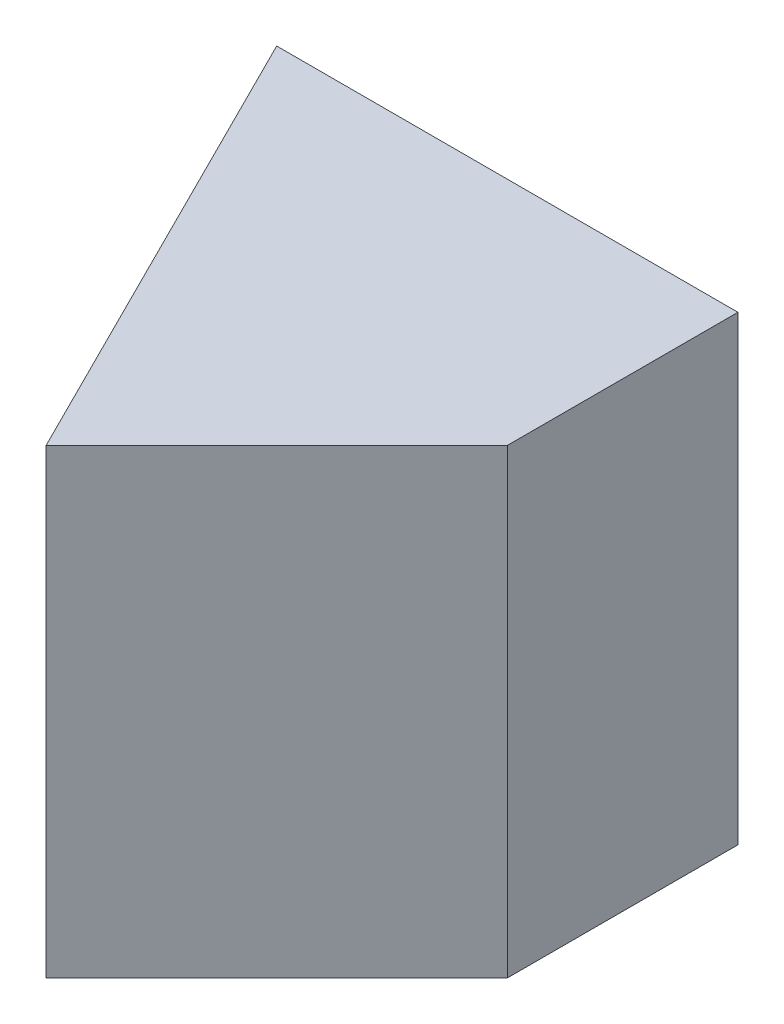
ISO-10303-21;
HEADER;
FILE_DESCRIPTION(('STEP AP214'),'2;1');
FILE_NAME('part.step','',(''),(''),'','','');
FILE_SCHEMA(('AUTOMOTIVE_DESIGN { 1 0 10303 214 1 1 1 1 }'));
ENDSEC;
DATA;
#1=APPLICATION_CONTEXT('core data for automotive mechanical design processes');
#2=APPLICATION_PROTOCOL_DEFINITION('international standard','automotive_design',2000,#1);
#3=PRODUCT_CONTEXT('',#1,'mechanical');
#4=PRODUCT('Part','Part','',(#3));
#5=PRODUCT_RELATED_PRODUCT_CATEGORY('part','',(#4));
#6=PRODUCT_DEFINITION_FORMATION('','',#4);
#7=PRODUCT_DEFINITION_CONTEXT('part definition',#1,'design');
#8=PRODUCT_DEFINITION('design','',#6,#7);
#9=PRODUCT_DEFINITION_SHAPE('','',#8);
#10=(LENGTH_UNIT() NAMED_UNIT(*) SI_UNIT(.MILLI.,.METRE.));
#11=(NAMED_UNIT(*) PLANE_ANGLE_UNIT() SI_UNIT($,.RADIAN.));
#12=(NAMED_UNIT(*) SI_UNIT($,.STERADIAN.) SOLID_ANGLE_UNIT());
#13=UNCERTAINTY_MEASURE_WITH_UNIT(LENGTH_MEASURE(1.E-05),#10,'distance_accuracy_value','');
#14=(GEOMETRIC_REPRESENTATION_CONTEXT(3) GLOBAL_UNCERTAINTY_ASSIGNED_CONTEXT((#13)) GLOBAL_UNIT_ASSIGNED_CONTEXT((#10,
#11,#12)) REPRESENTATION_CONTEXT('',''));
#15=CARTESIAN_POINT('',(0.,0.,0.));
#16=DIRECTION('',(0.,0.,1.));
#17=DIRECTION('',(1.,0.,0.));
#18=AXIS2_PLACEMENT_3D('',#15,#16,#17);
#19=CARTESIAN_POINT('',(0.,0.,20.));
#20=DIRECTION('',(0.,1.,0.));
#21=DIRECTION('',(0.,0.,1.));
#22=AXIS2_PLACEMENT_3D('',#19,#20,#21);
#23=PLANE('',#22);
#24=DIRECTION('',(0.,0.,-1.));
#25=VECTOR('',#24,1.);
#26=CARTESIAN_POINT('',(20.,0.,20.));
#27=LINE('',#26,#25);
#28=CARTESIAN_POINT('',(20.,0.,10.));
#29=VERTEX_POINT('',#28);
#30=CARTESIAN_POINT('',(20.,0.,0.));
#31=VERTEX_POINT('',#30);
#32=EDGE_CURVE('E11',#29,#31,#27,.T.);
#33=ORIENTED_EDGE('',*,*,#32,.F.);
#34=DIRECTION('',(-0.707106781186548,0.,0.707106781186548));
#35=VECTOR('',#34,1.);
#36=CARTESIAN_POINT('',(20.,0.,10.));
#37=LINE('',#36,#35);
#38=CARTESIAN_POINT('',(10.,0.,20.));
#39=VERTEX_POINT('',#38);
#40=EDGE_CURVE('E72',#29,#39,#37,.T.);
#41=ORIENTED_EDGE('',*,*,#40,.T.);
#42=DIRECTION('',(-0.447213595499958,0.,-0.894427190999916));
#43=VECTOR('',#42,1.);
#44=CARTESIAN_POINT('',(0.,0.,0.));
#45=LINE('',#44,#43);
#46=CARTESIAN_POINT('',(0.,0.,0.));
#47=VERTEX_POINT('',#46);
#48=EDGE_CURVE('E90',#39,#47,#45,.T.);
#49=ORIENTED_EDGE('',*,*,#48,.T.);
#50=DIRECTION('',(1.,0.,0.));
#51=VECTOR('',#50,1.);
#52=CARTESIAN_POINT('',(0.,0.,0.));
#53=LINE('',#52,#51);
#54=EDGE_CURVE('E88',#47,#31,#53,.T.);
#55=ORIENTED_EDGE('',*,*,#54,.T.);
#56=EDGE_LOOP('',(#33,#41,#49,#55));
#57=FACE_BOUND('',#56,.T.);
#58=ADVANCED_FACE('F33',(#57),#23,.F.);
#59=CARTESIAN_POINT('',(20.,0.,20.));
#60=DIRECTION('',(-1.,0.,0.));
#61=DIRECTION('',(0.,0.,1.));
#62=AXIS2_PLACEMENT_3D('',#59,#60,#61);
#63=PLANE('',#62);
#64=DIRECTION('',(0.,0.,-1.));
#65=VECTOR('',#64,1.);
#66=CARTESIAN_POINT('',(20.,20.,20.));
#67=LINE('',#66,#65);
#68=CARTESIAN_POINT('',(20.,20.,10.));
#69=VERTEX_POINT('',#68);
#70=CARTESIAN_POINT('',(20.,20.,0.));
#71=VERTEX_POINT('',#70);
#72=EDGE_CURVE('E40',#69,#71,#67,.T.);
#73=ORIENTED_EDGE('',*,*,#72,.F.);
#74=DIRECTION('',(0.,1.,0.));
#75=VECTOR('',#74,1.);
#76=CARTESIAN_POINT('',(20.,0.,10.));
#77=LINE('',#76,#75);
#78=EDGE_CURVE('E75',#29,#69,#77,.T.);
#79=ORIENTED_EDGE('',*,*,#78,.F.);
#80=ORIENTED_EDGE('',*,*,#32,.T.);
#81=DIRECTION('',(0.,1.,0.));
#82=VECTOR('',#81,1.);
#83=CARTESIAN_POINT('',(20.,0.,0.));
#84=LINE('',#83,#82);
#85=EDGE_CURVE('E93',#31,#71,#84,.T.);
#86=ORIENTED_EDGE('',*,*,#85,.T.);
#87=EDGE_LOOP('',(#73,#79,#80,#86));
#88=FACE_BOUND('',#87,.T.);
#89=ADVANCED_FACE('F84',(#88),#63,.F.);
#90=CARTESIAN_POINT('',(0.,20.,20.));
#91=DIRECTION('',(0.,-1.,0.));
#92=DIRECTION('',(0.,0.,-1.));
#93=AXIS2_PLACEMENT_3D('',#90,#91,#92);
#94=PLANE('',#93);
#95=DIRECTION('',(-0.447213595499958,0.,-0.894427190999916));
#96=VECTOR('',#95,1.);
#97=CARTESIAN_POINT('',(0.,20.,0.));
#98=LINE('',#97,#96);
#99=CARTESIAN_POINT('',(10.,20.,20.));
#100=VERTEX_POINT('',#99);
#101=CARTESIAN_POINT('',(0.,20.,0.));
#102=VERTEX_POINT('',#101);
#103=EDGE_CURVE('E47',#100,#102,#98,.T.);
#104=ORIENTED_EDGE('',*,*,#103,.F.);
#105=DIRECTION('',(-0.707106781186548,0.,0.707106781186548));
#106=VECTOR('',#105,1.);
#107=CARTESIAN_POINT('',(20.,20.,10.));
#108=LINE('',#107,#106);
#109=EDGE_CURVE('E81',#69,#100,#108,.T.);
#110=ORIENTED_EDGE('',*,*,#109,.F.);
#111=ORIENTED_EDGE('',*,*,#72,.T.);
#112=DIRECTION('',(-1.,0.,0.));
#113=VECTOR('',#112,1.);
#114=CARTESIAN_POINT('',(0.,20.,0.));
#115=LINE('',#114,#113);
#116=EDGE_CURVE('E98',#71,#102,#115,.T.);
#117=ORIENTED_EDGE('',*,*,#116,.T.);
#118=EDGE_LOOP('',(#104,#110,#111,#117));
#119=FACE_BOUND('',#118,.T.);
#120=ADVANCED_FACE('F107',(#119),#94,.F.);
#121=CARTESIAN_POINT('',(0.,0.,0.));
#122=DIRECTION('',(0.,0.,-1.));
#123=DIRECTION('',(-1.,0.,0.));
#124=AXIS2_PLACEMENT_3D('',#121,#122,#123);
#125=PLANE('',#124);
#126=DIRECTION('',(0.,-1.,0.));
#127=VECTOR('',#126,1.);
#128=CARTESIAN_POINT('',(0.,0.,0.));
#129=LINE('',#128,#127);
#130=EDGE_CURVE('E94',#102,#47,#129,.T.);
#131=ORIENTED_EDGE('',*,*,#130,.F.);
#132=ORIENTED_EDGE('',*,*,#116,.F.);
#133=ORIENTED_EDGE('',*,*,#85,.F.);
#134=ORIENTED_EDGE('',*,*,#54,.F.);
#135=EDGE_LOOP('',(#131,#132,#133,#134));
#136=FACE_BOUND('',#135,.T.);
#137=ADVANCED_FACE('F97',(#136),#125,.T.);
#138=CARTESIAN_POINT('',(0.,0.,0.));
#139=DIRECTION('',(0.894427190999916,0.,-0.447213595499958));
#140=DIRECTION('',(-0.447213595499958,0.,-0.894427190999916));
#141=AXIS2_PLACEMENT_3D('',#138,#139,#140);
#142=PLANE('',#141);
#143=ORIENTED_EDGE('',*,*,#103,.T.);
#144=ORIENTED_EDGE('',*,*,#130,.T.);
#145=ORIENTED_EDGE('',*,*,#48,.F.);
#146=DIRECTION('',(0.,1.,0.));
#147=VECTOR('',#146,1.);
#148=CARTESIAN_POINT('',(10.,0.,20.));
#149=LINE('',#148,#147);
#150=EDGE_CURVE('E76',#39,#100,#149,.T.);
#151=ORIENTED_EDGE('',*,*,#150,.T.);
#152=EDGE_LOOP('',(#143,#144,#145,#151));
#153=FACE_BOUND('',#152,.T.);
#154=ADVANCED_FACE('F106',(#153),#142,.F.);
#155=CARTESIAN_POINT('',(20.,0.,10.));
#156=DIRECTION('',(-0.707106781186548,0.,-0.707106781186548));
#157=DIRECTION('',(-0.707106781186548,0.,0.707106781186548));
#158=AXIS2_PLACEMENT_3D('',#155,#156,#157);
#159=PLANE('',#158);
#160=ORIENTED_EDGE('',*,*,#109,.T.);
#161=ORIENTED_EDGE('',*,*,#150,.F.);
#162=ORIENTED_EDGE('',*,*,#40,.F.);
#163=ORIENTED_EDGE('',*,*,#78,.T.);
#164=EDGE_LOOP('',(#160,#161,#162,#163));
#165=FACE_BOUND('',#164,.T.);
#166=ADVANCED_FACE('F74',(#165),#159,.F.);
#167=CLOSED_SHELL('',(#58,#89,#120,#137,#154,#166));
#168=MANIFOLD_SOLID_BREP('B2',#167);
#169=ADVANCED_BREP_SHAPE_REPRESENTATION('',(#18,#168),#14);
#170=SHAPE_DEFINITION_REPRESENTATION(#9,#169);
ENDSEC;
END-ISO-10303-21;
